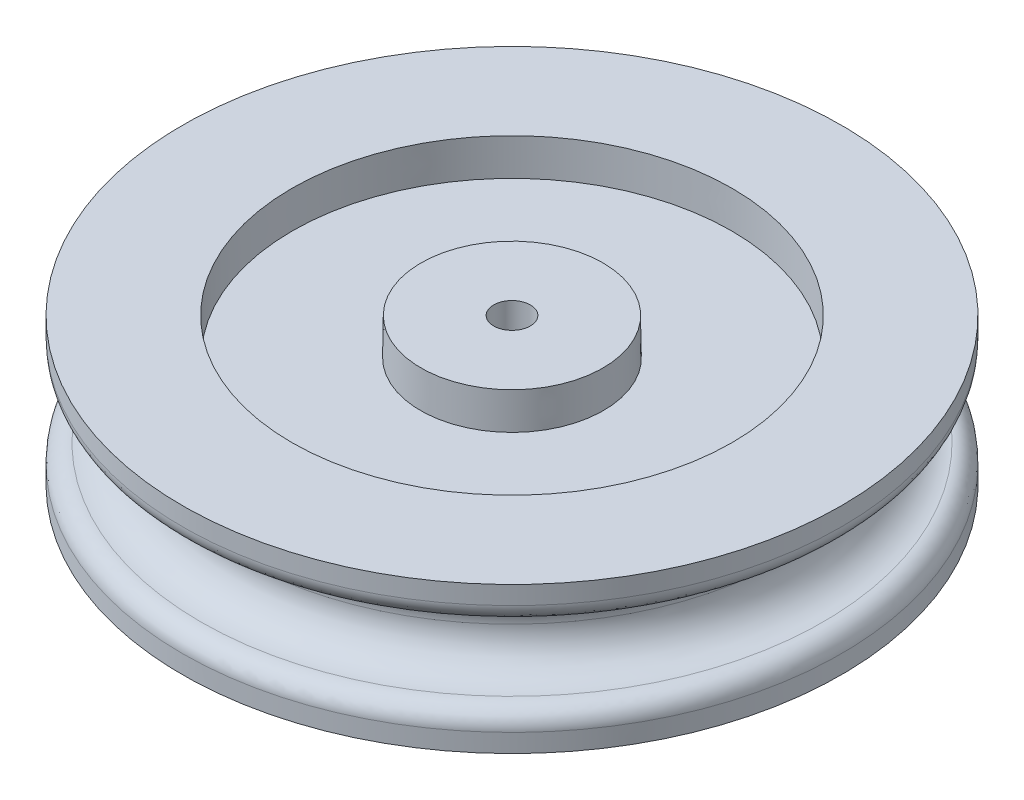
ISO-10303-21;
HEADER;
FILE_DESCRIPTION(('STEP AP214'),'2;1');
FILE_NAME('part.step','',(''),(''),'','','');
FILE_SCHEMA(('AUTOMOTIVE_DESIGN { 1 0 10303 214 1 1 1 1 }'));
ENDSEC;
DATA;
#1=APPLICATION_CONTEXT('core data for automotive mechanical design processes');
#2=APPLICATION_PROTOCOL_DEFINITION('international standard','automotive_design',2000,#1);
#3=PRODUCT_CONTEXT('',#1,'mechanical');
#4=PRODUCT('Part','Part','',(#3));
#5=PRODUCT_RELATED_PRODUCT_CATEGORY('part','',(#4));
#6=PRODUCT_DEFINITION_FORMATION('','',#4);
#7=PRODUCT_DEFINITION_CONTEXT('part definition',#1,'design');
#8=PRODUCT_DEFINITION('design','',#6,#7);
#9=PRODUCT_DEFINITION_SHAPE('','',#8);
#10=(LENGTH_UNIT() NAMED_UNIT(*) SI_UNIT(.MILLI.,.METRE.));
#11=(NAMED_UNIT(*) PLANE_ANGLE_UNIT() SI_UNIT($,.RADIAN.));
#12=(NAMED_UNIT(*) SI_UNIT($,.STERADIAN.) SOLID_ANGLE_UNIT());
#13=UNCERTAINTY_MEASURE_WITH_UNIT(LENGTH_MEASURE(1.E-05),#10,'distance_accuracy_value','');
#14=(GEOMETRIC_REPRESENTATION_CONTEXT(3) GLOBAL_UNCERTAINTY_ASSIGNED_CONTEXT((#13)) GLOBAL_UNIT_ASSIGNED_CONTEXT((#10,
#11,#12)) REPRESENTATION_CONTEXT('',''));
#15=CARTESIAN_POINT('',(0.,0.,0.));
#16=DIRECTION('',(0.,0.,1.));
#17=DIRECTION('',(1.,0.,0.));
#18=AXIS2_PLACEMENT_3D('',#15,#16,#17);
#19=CARTESIAN_POINT('',(0.,-1.2,0.));
#20=DIRECTION('',(0.,-1.,0.));
#21=DIRECTION('',(0.,0.,-1.));
#22=AXIS2_PLACEMENT_3D('',#19,#20,#21);
#23=CONICAL_SURFACE('',#22,1.,0.785398163397448);
#24=CARTESIAN_POINT('',(0.,-1.2,0.));
#25=DIRECTION('',(0.,-1.,0.));
#26=DIRECTION('',(0.,0.,-1.));
#27=AXIS2_PLACEMENT_3D('',#24,#25,#26);
#28=CIRCLE('',#27,1.);
#29=CARTESIAN_POINT('',(0.,-1.2,-1.));
#30=VERTEX_POINT('',#29);
#31=EDGE_CURVE('E41',#30,#30,#28,.T.);
#32=ORIENTED_EDGE('',*,*,#31,.F.);
#33=EDGE_LOOP('',(#32));
#34=FACE_BOUND('',#33,.T.);
#35=CARTESIAN_POINT('',(0.,-1.49999999999995,0.));
#36=DIRECTION('',(0.,-1.,0.));
#37=DIRECTION('',(0.,0.,-1.));
#38=AXIS2_PLACEMENT_3D('',#35,#36,#37);
#39=CIRCLE('',#38,1.29999999999995);
#40=CARTESIAN_POINT('',(0.,-1.49999999999995,-1.29999999999995));
#41=VERTEX_POINT('',#40);
#42=EDGE_CURVE('E17',#41,#41,#39,.F.);
#43=ORIENTED_EDGE('',*,*,#42,.F.);
#44=EDGE_LOOP('',(#43));
#45=FACE_BOUND('',#44,.T.);
#46=ADVANCED_FACE('F14',(#34,#45),#23,.F.);
#47=CARTESIAN_POINT('',(0.,2.7,0.));
#48=DIRECTION('',(0.,-1.,0.));
#49=DIRECTION('',(0.,0.,-1.));
#50=AXIS2_PLACEMENT_3D('',#47,#48,#49);
#51=CYLINDRICAL_SURFACE('',#50,1.);
#52=CARTESIAN_POINT('',(0.,2.7,0.));
#53=DIRECTION('',(0.,-1.,0.));
#54=DIRECTION('',(0.,0.,-1.));
#55=AXIS2_PLACEMENT_3D('',#52,#53,#54);
#56=CIRCLE('',#55,1.);
#57=CARTESIAN_POINT('',(0.,2.7,-1.));
#58=VERTEX_POINT('',#57);
#59=EDGE_CURVE('E76',#58,#58,#56,.T.);
#60=ORIENTED_EDGE('',*,*,#59,.F.);
#61=EDGE_LOOP('',(#60));
#62=FACE_BOUND('',#61,.T.);
#63=ORIENTED_EDGE('',*,*,#31,.T.);
#64=EDGE_LOOP('',(#63));
#65=FACE_BOUND('',#64,.T.);
#66=ADVANCED_FACE('F87',(#62,#65),#51,.F.);
#67=CARTESIAN_POINT('',(0.,-1.5,0.));
#68=DIRECTION('',(0.,-1.,0.));
#69=DIRECTION('',(0.,0.,-1.));
#70=AXIS2_PLACEMENT_3D('',#67,#68,#69);
#71=PLANE('',#70);
#72=ORIENTED_EDGE('',*,*,#42,.T.);
#73=EDGE_LOOP('',(#72));
#74=FACE_BOUND('',#73,.T.);
#75=CARTESIAN_POINT('',(0.,-1.49999999999995,0.));
#76=DIRECTION('',(0.,1.,0.));
#77=DIRECTION('',(0.,0.,1.));
#78=AXIS2_PLACEMENT_3D('',#75,#76,#77);
#79=CIRCLE('',#78,2.465091146);
#80=CARTESIAN_POINT('',(0.,-1.49999999999995,2.465091146));
#81=VERTEX_POINT('',#80);
#82=EDGE_CURVE('E74',#81,#81,#79,.T.);
#83=ORIENTED_EDGE('',*,*,#82,.F.);
#84=EDGE_LOOP('',(#83));
#85=FACE_BOUND('',#84,.T.);
#86=ADVANCED_FACE('F83',(#74,#85),#71,.T.);
#87=CARTESIAN_POINT('',(0.,2.7,0.));
#88=DIRECTION('',(0.,1.,0.));
#89=DIRECTION('',(0.,0.,1.));
#90=AXIS2_PLACEMENT_3D('',#87,#88,#89);
#91=PLANE('',#90);
#92=CARTESIAN_POINT('',(0.,2.7,0.));
#93=DIRECTION('',(0.,1.,0.));
#94=DIRECTION('',(0.,0.,1.));
#95=AXIS2_PLACEMENT_3D('',#92,#93,#94);
#96=CIRCLE('',#95,0.5);
#97=CARTESIAN_POINT('',(0.,2.7,0.5));
#98=VERTEX_POINT('',#97);
#99=EDGE_CURVE('E71',#98,#98,#96,.F.);
#100=ORIENTED_EDGE('',*,*,#99,.F.);
#101=EDGE_LOOP('',(#100));
#102=FACE_BOUND('',#101,.T.);
#103=ORIENTED_EDGE('',*,*,#59,.T.);
#104=EDGE_LOOP('',(#103));
#105=FACE_BOUND('',#104,.T.);
#106=ADVANCED_FACE('F183',(#102,#105),#91,.F.);
#107=CARTESIAN_POINT('',(0.,1.,0.));
#108=DIRECTION('',(0.,1.,0.));
#109=DIRECTION('',(0.,0.,1.));
#110=AXIS2_PLACEMENT_3D('',#107,#108,#109);
#111=CONICAL_SURFACE('',#110,2.5,0.0139626341667435);
#112=CARTESIAN_POINT('',(0.,1.,0.));
#113=DIRECTION('',(0.,1.,0.));
#114=DIRECTION('',(0.,0.,1.));
#115=AXIS2_PLACEMENT_3D('',#112,#113,#114);
#116=CIRCLE('',#115,2.5);
#117=CARTESIAN_POINT('',(0.,1.,2.5));
#118=VERTEX_POINT('',#117);
#119=EDGE_CURVE('E68',#118,#118,#116,.T.);
#120=ORIENTED_EDGE('',*,*,#119,.F.);
#121=EDGE_LOOP('',(#120));
#122=FACE_BOUND('',#121,.T.);
#123=ORIENTED_EDGE('',*,*,#82,.T.);
#124=EDGE_LOOP('',(#123));
#125=FACE_BOUND('',#124,.T.);
#126=ADVANCED_FACE('F179',(#122,#125),#111,.T.);
#127=CARTESIAN_POINT('',(0.,2.7,0.));
#128=DIRECTION('',(0.,1.,0.));
#129=DIRECTION('',(0.,0.,1.));
#130=AXIS2_PLACEMENT_3D('',#127,#128,#129);
#131=CYLINDRICAL_SURFACE('',#130,0.5);
#132=CARTESIAN_POINT('',(0.,4.,0.));
#133=DIRECTION('',(0.,1.,0.));
#134=DIRECTION('',(0.,0.,1.));
#135=AXIS2_PLACEMENT_3D('',#132,#133,#134);
#136=CIRCLE('',#135,0.5);
#137=CARTESIAN_POINT('',(0.,4.,0.5));
#138=VERTEX_POINT('',#137);
#139=EDGE_CURVE('E65',#138,#138,#136,.F.);
#140=ORIENTED_EDGE('',*,*,#139,.F.);
#141=EDGE_LOOP('',(#140));
#142=FACE_BOUND('',#141,.T.);
#143=ORIENTED_EDGE('',*,*,#99,.T.);
#144=EDGE_LOOP('',(#143));
#145=FACE_BOUND('',#144,.T.);
#146=ADVANCED_FACE('F175',(#142,#145),#131,.F.);
#147=CARTESIAN_POINT('',(0.,1.,-2.5));
#148=DIRECTION('',(0.,-1.,0.));
#149=DIRECTION('',(0.,0.,-1.));
#150=AXIS2_PLACEMENT_3D('',#147,#148,#149);
#151=PLANE('',#150);
#152=ORIENTED_EDGE('',*,*,#119,.T.);
#153=EDGE_LOOP('',(#152));
#154=FACE_BOUND('',#153,.T.);
#155=CARTESIAN_POINT('',(0.,0.99999999999989,0.));
#156=DIRECTION('',(0.,-1.,0.));
#157=DIRECTION('',(0.,0.,-1.));
#158=AXIS2_PLACEMENT_3D('',#155,#156,#157);
#159=CIRCLE('',#158,6.);
#160=CARTESIAN_POINT('',(0.,0.99999999999989,-6.));
#161=VERTEX_POINT('',#160);
#162=EDGE_CURVE('E62',#161,#161,#159,.F.);
#163=ORIENTED_EDGE('',*,*,#162,.F.);
#164=EDGE_LOOP('',(#163));
#165=FACE_BOUND('',#164,.T.);
#166=ADVANCED_FACE('F171',(#154,#165),#151,.T.);
#167=CARTESIAN_POINT('',(0.,4.,-2.5));
#168=DIRECTION('',(0.,1.,0.));
#169=DIRECTION('',(0.,0.,1.));
#170=AXIS2_PLACEMENT_3D('',#167,#168,#169);
#171=PLANE('',#170);
#172=ORIENTED_EDGE('',*,*,#139,.T.);
#173=EDGE_LOOP('',(#172));
#174=FACE_BOUND('',#173,.T.);
#175=CARTESIAN_POINT('',(0.,4.,0.));
#176=DIRECTION('',(0.,-1.,0.));
#177=DIRECTION('',(0.,0.,-1.));
#178=AXIS2_PLACEMENT_3D('',#175,#176,#177);
#179=CIRCLE('',#178,2.486036459);
#180=CARTESIAN_POINT('',(0.,4.,-2.486036459));
#181=VERTEX_POINT('',#180);
#182=EDGE_CURVE('E59',#181,#181,#179,.T.);
#183=ORIENTED_EDGE('',*,*,#182,.F.);
#184=EDGE_LOOP('',(#183));
#185=FACE_BOUND('',#184,.T.);
#186=ADVANCED_FACE('F167',(#174,#185),#171,.T.);
#187=CARTESIAN_POINT('',(0.,1.,0.));
#188=DIRECTION('',(0.,-1.,0.));
#189=DIRECTION('',(0.,0.,-1.));
#190=AXIS2_PLACEMENT_3D('',#187,#188,#189);
#191=CONICAL_SURFACE('',#190,6.,0.0139626335668602);
#192=CARTESIAN_POINT('',(0.,0.,0.));
#193=DIRECTION('',(0.,-1.,0.));
#194=DIRECTION('',(0.,0.,-1.));
#195=AXIS2_PLACEMENT_3D('',#192,#193,#194);
#196=CIRCLE('',#195,6.013963541);
#197=CARTESIAN_POINT('',(0.,0.,-6.013963541));
#198=VERTEX_POINT('',#197);
#199=EDGE_CURVE('E56',#198,#198,#196,.F.);
#200=ORIENTED_EDGE('',*,*,#199,.F.);
#201=EDGE_LOOP('',(#200));
#202=FACE_BOUND('',#201,.T.);
#203=ORIENTED_EDGE('',*,*,#162,.T.);
#204=EDGE_LOOP('',(#203));
#205=FACE_BOUND('',#204,.T.);
#206=ADVANCED_FACE('F163',(#202,#205),#191,.F.);
#207=CARTESIAN_POINT('',(0.,3.,0.));
#208=DIRECTION('',(0.,-1.,0.));
#209=DIRECTION('',(0.,0.,-1.));
#210=AXIS2_PLACEMENT_3D('',#207,#208,#209);
#211=CONICAL_SURFACE('',#210,2.5,0.0139626335668606);
#212=ORIENTED_EDGE('',*,*,#182,.T.);
#213=EDGE_LOOP('',(#212));
#214=FACE_BOUND('',#213,.T.);
#215=CARTESIAN_POINT('',(0.,2.99999999999989,0.));
#216=DIRECTION('',(0.,-1.,0.));
#217=DIRECTION('',(0.,0.,-1.));
#218=AXIS2_PLACEMENT_3D('',#215,#216,#217);
#219=CIRCLE('',#218,2.5);
#220=CARTESIAN_POINT('',(0.,2.99999999999989,-2.5));
#221=VERTEX_POINT('',#220);
#222=EDGE_CURVE('E53',#221,#221,#219,.T.);
#223=ORIENTED_EDGE('',*,*,#222,.F.);
#224=EDGE_LOOP('',(#223));
#225=FACE_BOUND('',#224,.T.);
#226=ADVANCED_FACE('F159',(#214,#225),#211,.T.);
#227=CARTESIAN_POINT('',(0.,0.,-6.));
#228=DIRECTION('',(0.,-1.,0.));
#229=DIRECTION('',(0.,0.,-1.));
#230=AXIS2_PLACEMENT_3D('',#227,#228,#229);
#231=PLANE('',#230);
#232=ORIENTED_EDGE('',*,*,#199,.T.);
#233=EDGE_LOOP('',(#232));
#234=FACE_BOUND('',#233,.T.);
#235=CARTESIAN_POINT('',(0.,0.,0.));
#236=DIRECTION('',(0.,-1.,0.));
#237=DIRECTION('',(0.,0.,-1.));
#238=AXIS2_PLACEMENT_3D('',#235,#236,#237);
#239=CIRCLE('',#238,9.);
#240=CARTESIAN_POINT('',(0.,0.,-9.));
#241=VERTEX_POINT('',#240);
#242=EDGE_CURVE('E50',#241,#241,#239,.F.);
#243=ORIENTED_EDGE('',*,*,#242,.F.);
#244=EDGE_LOOP('',(#243));
#245=FACE_BOUND('',#244,.T.);
#246=ADVANCED_FACE('F155',(#234,#245),#231,.T.);
#247=CARTESIAN_POINT('',(0.,3.,-6.));
#248=DIRECTION('',(0.,1.,0.));
#249=DIRECTION('',(0.,0.,1.));
#250=AXIS2_PLACEMENT_3D('',#247,#248,#249);
#251=PLANE('',#250);
#252=ORIENTED_EDGE('',*,*,#222,.T.);
#253=EDGE_LOOP('',(#252));
#254=FACE_BOUND('',#253,.T.);
#255=CARTESIAN_POINT('',(0.,3.,0.));
#256=DIRECTION('',(0.,1.,0.));
#257=DIRECTION('',(0.,0.,1.));
#258=AXIS2_PLACEMENT_3D('',#255,#256,#257);
#259=CIRCLE('',#258,6.);
#260=CARTESIAN_POINT('',(0.,3.,6.));
#261=VERTEX_POINT('',#260);
#262=EDGE_CURVE('E37',#261,#261,#259,.F.);
#263=ORIENTED_EDGE('',*,*,#262,.F.);
#264=EDGE_LOOP('',(#263));
#265=FACE_BOUND('',#264,.T.);
#266=ADVANCED_FACE('F151',(#254,#265),#251,.T.);
#267=CARTESIAN_POINT('',(0.,0.,0.));
#268=DIRECTION('',(0.,-1.,0.));
#269=DIRECTION('',(0.,0.,-1.));
#270=AXIS2_PLACEMENT_3D('',#267,#268,#269);
#271=CYLINDRICAL_SURFACE('',#270,9.);
#272=CARTESIAN_POINT('',(0.,0.499999999999782,0.));
#273=DIRECTION('',(0.,1.,0.));
#274=DIRECTION('',(0.,0.,1.));
#275=AXIS2_PLACEMENT_3D('',#272,#273,#274);
#276=CIRCLE('',#275,9.);
#277=CARTESIAN_POINT('',(0.,0.499999999999782,9.));
#278=VERTEX_POINT('',#277);
#279=EDGE_CURVE('E33',#278,#278,#276,.T.);
#280=ORIENTED_EDGE('',*,*,#279,.F.);
#281=EDGE_LOOP('',(#280));
#282=FACE_BOUND('',#281,.T.);
#283=ORIENTED_EDGE('',*,*,#242,.T.);
#284=EDGE_LOOP('',(#283));
#285=FACE_BOUND('',#284,.T.);
#286=ADVANCED_FACE('F147',(#282,#285),#271,.T.);
#287=CARTESIAN_POINT('',(0.,3.,0.));
#288=DIRECTION('',(0.,1.,0.));
#289=DIRECTION('',(0.,0.,1.));
#290=AXIS2_PLACEMENT_3D('',#287,#288,#289);
#291=CONICAL_SURFACE('',#290,6.,0.0139626335668602);
#292=ORIENTED_EDGE('',*,*,#262,.T.);
#293=EDGE_LOOP('',(#292));
#294=FACE_BOUND('',#293,.T.);
#295=CARTESIAN_POINT('',(0.,3.99999999999989,0.));
#296=DIRECTION('',(0.,1.,0.));
#297=DIRECTION('',(0.,0.,1.));
#298=AXIS2_PLACEMENT_3D('',#295,#296,#297);
#299=CIRCLE('',#298,6.013963541);
#300=CARTESIAN_POINT('',(0.,3.99999999999989,6.013963541));
#301=VERTEX_POINT('',#300);
#302=EDGE_CURVE('E36',#301,#301,#299,.F.);
#303=ORIENTED_EDGE('',*,*,#302,.F.);
#304=EDGE_LOOP('',(#303));
#305=FACE_BOUND('',#304,.T.);
#306=ADVANCED_FACE('F143',(#294,#305),#291,.F.);
#307=CARTESIAN_POINT('',(0.,1.,8.50000000000022));
#308=CARTESIAN_POINT('',(0.,0.999999999999873,8.79289321881367));
#309=CARTESIAN_POINT('',(0.,0.792893218813234,9.00000000000013));
#310=CARTESIAN_POINT('',(0.,0.499999999999782,9.));
#311=(BOUNDED_CURVE() B_SPLINE_CURVE(3,(#307,#308,#309,#310),.UNSPECIFIED.,.F.,
.F.) B_SPLINE_CURVE_WITH_KNOTS((4,4),(0.,1.),
.UNSPECIFIED.) CURVE() GEOMETRIC_REPRESENTATION_ITEM() RATIONAL_B_SPLINE_CURVE((1.,
0.804737854124365,0.804737854124365,1.)) REPRESENTATION_ITEM(''));
#312=CARTESIAN_POINT('',(0.,0.5,0.));
#313=DIRECTION('',(0.,1.,0.));
#314=AXIS1_PLACEMENT('',#312,#313);
#315=SURFACE_OF_REVOLUTION('',#311,#314);
#316=ORIENTED_EDGE('',*,*,#279,.T.);
#317=EDGE_LOOP('',(#316));
#318=FACE_BOUND('',#317,.T.);
#319=CARTESIAN_POINT('',(0.,1.,0.));
#320=DIRECTION('',(0.,1.,0.));
#321=DIRECTION('',(0.,0.,1.));
#322=AXIS2_PLACEMENT_3D('',#319,#320,#321);
#323=CIRCLE('',#322,8.49999999999991);
#324=CARTESIAN_POINT('',(0.,1.,8.49999999999991));
#325=VERTEX_POINT('',#324);
#326=EDGE_CURVE('E38',#325,#325,#323,.T.);
#327=ORIENTED_EDGE('',*,*,#326,.F.);
#328=EDGE_LOOP('',(#327));
#329=FACE_BOUND('',#328,.T.);
#330=ADVANCED_FACE('F139',(#318,#329),#315,.F.);
#331=CARTESIAN_POINT('',(0.,4.,-9.));
#332=DIRECTION('',(0.,1.,0.));
#333=DIRECTION('',(0.,0.,1.));
#334=AXIS2_PLACEMENT_3D('',#331,#332,#333);
#335=PLANE('',#334);
#336=ORIENTED_EDGE('',*,*,#302,.T.);
#337=EDGE_LOOP('',(#336));
#338=FACE_BOUND('',#337,.T.);
#339=CARTESIAN_POINT('',(0.,4.,0.));
#340=DIRECTION('',(0.,-1.,0.));
#341=DIRECTION('',(1.,0.,0.));
#342=AXIS2_PLACEMENT_3D('',#339,#340,#341);
#343=CIRCLE('',#342,9.);
#344=CARTESIAN_POINT('',(9.,4.,0.));
#345=VERTEX_POINT('',#344);
#346=EDGE_CURVE('E32',#345,#345,#343,.T.);
#347=ORIENTED_EDGE('',*,*,#346,.F.);
#348=EDGE_LOOP('',(#347));
#349=FACE_BOUND('',#348,.T.);
#350=ADVANCED_FACE('F135',(#338,#349),#335,.T.);
#351=CARTESIAN_POINT('',(0.,1.99999999999999,7.49999999999991));
#352=CARTESIAN_POINT('',(0.,1.41421356237309,7.49999999999991));
#353=CARTESIAN_POINT('',(0.,0.999999999999996,7.91421356237301));
#354=CARTESIAN_POINT('',(0.,1.,8.49999999999991));
#355=(BOUNDED_CURVE() B_SPLINE_CURVE(3,(#351,#352,#353,#354),.UNSPECIFIED.,.F.,
.F.) B_SPLINE_CURVE_WITH_KNOTS((4,4),(0.,1.),
.UNSPECIFIED.) CURVE() GEOMETRIC_REPRESENTATION_ITEM() RATIONAL_B_SPLINE_CURVE((1.,
0.804737854124364,0.804737854124364,1.)) REPRESENTATION_ITEM(''));
#356=CARTESIAN_POINT('',(0.,2.,0.));
#357=DIRECTION('',(0.,1.,0.));
#358=AXIS1_PLACEMENT('',#356,#357);
#359=SURFACE_OF_REVOLUTION('',#355,#358);
#360=ORIENTED_EDGE('',*,*,#326,.T.);
#361=EDGE_LOOP('',(#360));
#362=FACE_BOUND('',#361,.T.);
#363=CARTESIAN_POINT('',(0.,2.,0.));
#364=DIRECTION('',(0.,-1.,0.));
#365=DIRECTION('',(0.,0.,-1.));
#366=AXIS2_PLACEMENT_3D('',#363,#364,#365);
#367=CIRCLE('',#366,7.49999999999997);
#368=CARTESIAN_POINT('',(0.,2.,-7.49999999999997));
#369=VERTEX_POINT('',#368);
#370=EDGE_CURVE('E26',#369,#369,#367,.F.);
#371=ORIENTED_EDGE('',*,*,#370,.F.);
#372=EDGE_LOOP('',(#371));
#373=FACE_BOUND('',#372,.T.);
#374=ADVANCED_FACE('F132',(#362,#373),#359,.F.);
#375=CARTESIAN_POINT('',(0.,3.5,0.));
#376=DIRECTION('',(0.,-1.,0.));
#377=DIRECTION('',(1.,0.,0.));
#378=AXIS2_PLACEMENT_3D('',#375,#376,#377);
#379=CYLINDRICAL_SURFACE('',#378,9.);
#380=ORIENTED_EDGE('',*,*,#346,.T.);
#381=EDGE_LOOP('',(#380));
#382=FACE_BOUND('',#381,.T.);
#383=CARTESIAN_POINT('',(0.,3.49999999999994,0.));
#384=DIRECTION('',(0.,-1.,0.));
#385=DIRECTION('',(0.,0.,-1.));
#386=AXIS2_PLACEMENT_3D('',#383,#384,#385);
#387=CIRCLE('',#386,9.00000000000003);
#388=CARTESIAN_POINT('',(0.,3.49999999999994,-9.00000000000003));
#389=VERTEX_POINT('',#388);
#390=EDGE_CURVE('E21',#389,#389,#387,.T.);
#391=ORIENTED_EDGE('',*,*,#390,.F.);
#392=EDGE_LOOP('',(#391));
#393=FACE_BOUND('',#392,.T.);
#394=ADVANCED_FACE('F103',(#382,#393),#379,.T.);
#395=CARTESIAN_POINT('',(0.,2.,-7.49999999999997));
#396=CARTESIAN_POINT('',(0.,2.5857864376269,-7.49999999999997));
#397=CARTESIAN_POINT('',(0.,3.,-7.91421356237307));
#398=CARTESIAN_POINT('',(0.,3.,-8.49999999999997));
#399=(BOUNDED_CURVE() B_SPLINE_CURVE(3,(#395,#396,#397,#398),.UNSPECIFIED.,.F.,
.F.) B_SPLINE_CURVE_WITH_KNOTS((4,4),(0.,1.),
.UNSPECIFIED.) CURVE() GEOMETRIC_REPRESENTATION_ITEM() RATIONAL_B_SPLINE_CURVE((1.,
0.804737854124365,0.804737854124365,1.)) REPRESENTATION_ITEM(''));
#400=CARTESIAN_POINT('',(0.,2.,0.));
#401=DIRECTION('',(0.,-1.,0.));
#402=AXIS1_PLACEMENT('',#400,#401);
#403=SURFACE_OF_REVOLUTION('',#399,#402);
#404=CARTESIAN_POINT('',(0.,2.99999999999994,0.));
#405=DIRECTION('',(0.,-1.,0.));
#406=DIRECTION('',(0.,0.,-1.));
#407=AXIS2_PLACEMENT_3D('',#404,#405,#406);
#408=CIRCLE('',#407,8.50000000000031);
#409=CARTESIAN_POINT('',(0.,2.99999999999994,-8.50000000000031));
#410=VERTEX_POINT('',#409);
#411=EDGE_CURVE('E10',#410,#410,#408,.F.);
#412=ORIENTED_EDGE('',*,*,#411,.F.);
#413=EDGE_LOOP('',(#412));
#414=FACE_BOUND('',#413,.T.);
#415=ORIENTED_EDGE('',*,*,#370,.T.);
#416=EDGE_LOOP('',(#415));
#417=FACE_BOUND('',#416,.T.);
#418=ADVANCED_FACE('F97',(#414,#417),#403,.F.);
#419=CARTESIAN_POINT('',(0.,2.99999999999994,-8.50000000000031));
#420=CARTESIAN_POINT('',(0.,3.0000000000001,-8.79289321881363));
#421=CARTESIAN_POINT('',(0.,3.20710678118662,-9.00000000000003));
#422=CARTESIAN_POINT('',(0.,3.49999999999994,-9.00000000000003));
#423=(BOUNDED_CURVE() B_SPLINE_CURVE(3,(#419,#420,#421,#422),.UNSPECIFIED.,.F.,
.F.) B_SPLINE_CURVE_WITH_KNOTS((4,4),(0.,1.),
.UNSPECIFIED.) CURVE() GEOMETRIC_REPRESENTATION_ITEM() RATIONAL_B_SPLINE_CURVE((1.,
0.804737854124496,0.804737854124496,1.)) REPRESENTATION_ITEM(''));
#424=CARTESIAN_POINT('',(0.,3.5,0.));
#425=DIRECTION('',(0.,-1.,0.));
#426=AXIS1_PLACEMENT('',#424,#425);
#427=SURFACE_OF_REVOLUTION('',#423,#426);
#428=ORIENTED_EDGE('',*,*,#390,.T.);
#429=EDGE_LOOP('',(#428));
#430=FACE_BOUND('',#429,.T.);
#431=ORIENTED_EDGE('',*,*,#411,.T.);
#432=EDGE_LOOP('',(#431));
#433=FACE_BOUND('',#432,.T.);
#434=ADVANCED_FACE('F95',(#430,#433),#427,.F.);
#435=CLOSED_SHELL('',(#46,#66,#86,#106,#126,#146,#166,#186,#206,#226,#246,#266,#286,#306,#330,
#350,#374,#394,#418,#434));
#436=MANIFOLD_SOLID_BREP('B1',#435);
#437=ADVANCED_BREP_SHAPE_REPRESENTATION('',(#18,#436),#14);
#438=SHAPE_DEFINITION_REPRESENTATION(#9,#437);
ENDSEC;
END-ISO-10303-21;
